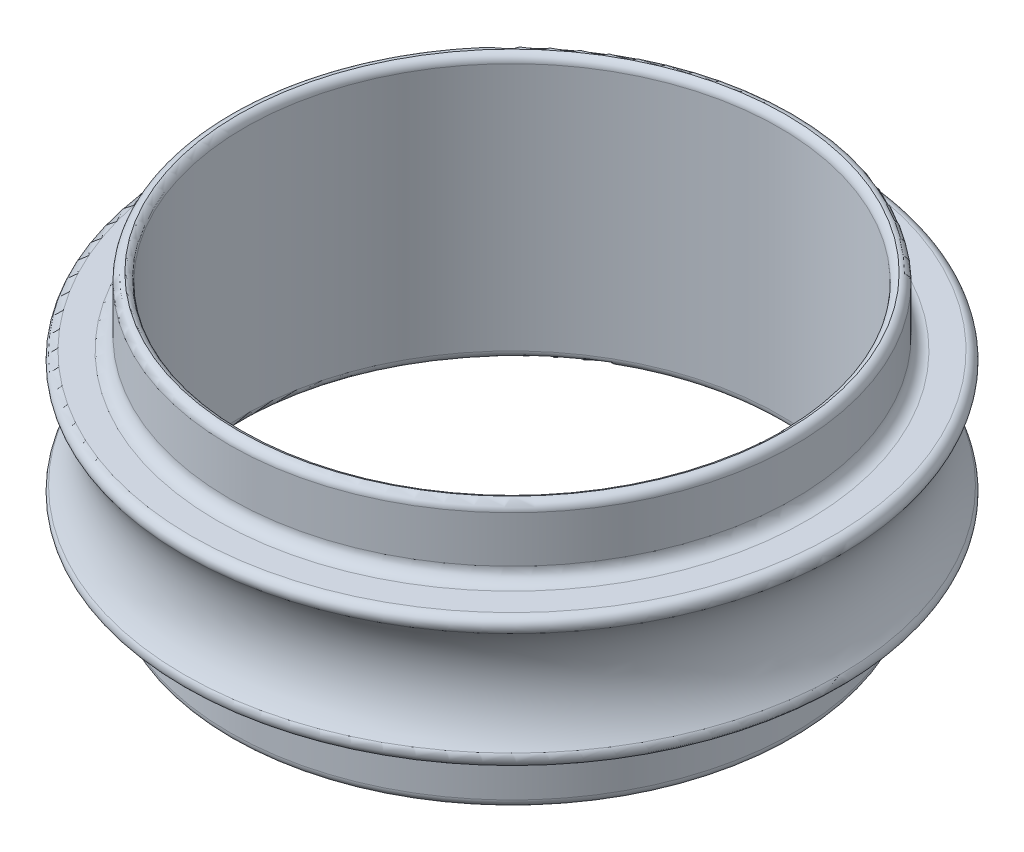
ISO-10303-21;
HEADER;
FILE_DESCRIPTION(('STEP AP214'),'2;1');
FILE_NAME('part.step','',(''),(''),'','','');
FILE_SCHEMA(('AUTOMOTIVE_DESIGN { 1 0 10303 214 1 1 1 1 }'));
ENDSEC;
DATA;
#1=APPLICATION_CONTEXT('core data for automotive mechanical design processes');
#2=APPLICATION_PROTOCOL_DEFINITION('international standard','automotive_design',2000,#1);
#3=PRODUCT_CONTEXT('',#1,'mechanical');
#4=PRODUCT('Part','Part','',(#3));
#5=PRODUCT_RELATED_PRODUCT_CATEGORY('part','',(#4));
#6=PRODUCT_DEFINITION_FORMATION('','',#4);
#7=PRODUCT_DEFINITION_CONTEXT('part definition',#1,'design');
#8=PRODUCT_DEFINITION('design','',#6,#7);
#9=PRODUCT_DEFINITION_SHAPE('','',#8);
#10=(LENGTH_UNIT() NAMED_UNIT(*) SI_UNIT(.MILLI.,.METRE.));
#11=(NAMED_UNIT(*) PLANE_ANGLE_UNIT() SI_UNIT($,.RADIAN.));
#12=(NAMED_UNIT(*) SI_UNIT($,.STERADIAN.) SOLID_ANGLE_UNIT());
#13=UNCERTAINTY_MEASURE_WITH_UNIT(LENGTH_MEASURE(1.E-05),#10,'distance_accuracy_value','');
#14=(GEOMETRIC_REPRESENTATION_CONTEXT(3) GLOBAL_UNCERTAINTY_ASSIGNED_CONTEXT((#13)) GLOBAL_UNIT_ASSIGNED_CONTEXT((#10,
#11,#12)) REPRESENTATION_CONTEXT('',''));
#15=CARTESIAN_POINT('',(0.,0.,0.));
#16=DIRECTION('',(0.,0.,1.));
#17=DIRECTION('',(1.,0.,0.));
#18=AXIS2_PLACEMENT_3D('',#15,#16,#17);
#19=CARTESIAN_POINT('',(0.,-34.5609634084468,0.));
#20=DIRECTION('',(0.,-1.,0.));
#21=DIRECTION('',(0.,0.,1.));
#22=AXIS2_PLACEMENT_3D('',#19,#20,#21);
#23=CYLINDRICAL_SURFACE('',#22,8.0645);
#24=CARTESIAN_POINT('',(0.,3.75456555751583,0.));
#25=DIRECTION('',(0.,1.,0.));
#26=DIRECTION('',(0.,0.,1.));
#27=AXIS2_PLACEMENT_3D('',#24,#25,#26);
#28=CIRCLE('',#27,8.0645);
#29=CARTESIAN_POINT('',(0.,3.75456555751583,8.0645));
#30=VERTEX_POINT('',#29);
#31=EDGE_CURVE('E10',#30,#30,#28,.T.);
#32=ORIENTED_EDGE('',*,*,#31,.T.);
#33=EDGE_LOOP('',(#32));
#34=FACE_BOUND('',#33,.T.);
#35=CARTESIAN_POINT('',(0.,-3.7465,0.));
#36=DIRECTION('',(0.,-1.,0.));
#37=DIRECTION('',(0.,0.,1.));
#38=AXIS2_PLACEMENT_3D('',#35,#36,#37);
#39=CIRCLE('',#38,8.0645);
#40=CARTESIAN_POINT('',(0.,-3.7465,8.0645));
#41=VERTEX_POINT('',#40);
#42=EDGE_CURVE('E22',#41,#41,#39,.T.);
#43=ORIENTED_EDGE('',*,*,#42,.T.);
#44=EDGE_LOOP('',(#43));
#45=FACE_BOUND('',#44,.T.);
#46=ADVANCED_FACE('F14',(#34,#45),#23,.F.);
#47=CARTESIAN_POINT('',(0.,3.75456555751583,0.));
#48=DIRECTION('',(0.,1.,0.));
#49=DIRECTION('',(0.,0.,1.));
#50=AXIS2_PLACEMENT_3D('',#47,#48,#49);
#51=TOROIDAL_SURFACE('',#50,8.3185,0.254);
#52=ORIENTED_EDGE('',*,*,#31,.F.);
#53=EDGE_LOOP('',(#52));
#54=FACE_BOUND('',#53,.T.);
#55=CARTESIAN_POINT('',(0.,4.0005,0.));
#56=DIRECTION('',(0.,1.,0.));
#57=DIRECTION('',(0.,0.,1.));
#58=AXIS2_PLACEMENT_3D('',#55,#56,#57);
#59=CIRCLE('',#58,8.255);
#60=CARTESIAN_POINT('',(0.,4.0005,8.255));
#61=VERTEX_POINT('',#60);
#62=EDGE_CURVE('E27',#61,#61,#59,.T.);
#63=ORIENTED_EDGE('',*,*,#62,.T.);
#64=EDGE_LOOP('',(#63));
#65=FACE_BOUND('',#64,.T.);
#66=ADVANCED_FACE('F71',(#54,#65),#51,.T.);
#67=CARTESIAN_POINT('',(0.,-1.9685,0.));
#68=DIRECTION('',(0.,1.,0.));
#69=DIRECTION('',(0.,0.,1.));
#70=AXIS2_PLACEMENT_3D('',#67,#68,#69);
#71=PLANE('',#70);
#72=CARTESIAN_POINT('',(0.,-1.9685,0.));
#73=DIRECTION('',(0.,-1.,0.));
#74=DIRECTION('',(0.,0.,1.));
#75=AXIS2_PLACEMENT_3D('',#72,#73,#74);
#76=CIRCLE('',#75,9.68108899871291);
#77=CARTESIAN_POINT('',(0.,-1.9685,9.68108899871291));
#78=VERTEX_POINT('',#77);
#79=EDGE_CURVE('E32',#78,#78,#76,.T.);
#80=ORIENTED_EDGE('',*,*,#79,.T.);
#81=EDGE_LOOP('',(#80));
#82=FACE_BOUND('',#81,.T.);
#83=CARTESIAN_POINT('',(0.,-1.9685,0.));
#84=DIRECTION('',(0.,1.,0.));
#85=DIRECTION('',(0.,0.,1.));
#86=AXIS2_PLACEMENT_3D('',#83,#84,#85);
#87=CIRCLE('',#86,8.89);
#88=CARTESIAN_POINT('',(0.,-1.9685,8.89));
#89=VERTEX_POINT('',#88);
#90=EDGE_CURVE('E35',#89,#89,#87,.T.);
#91=ORIENTED_EDGE('',*,*,#90,.T.);
#92=EDGE_LOOP('',(#91));
#93=FACE_BOUND('',#92,.T.);
#94=ADVANCED_FACE('F73',(#82,#93),#71,.F.);
#95=CARTESIAN_POINT('',(0.,-2.3495,0.));
#96=DIRECTION('',(0.,1.,0.));
#97=DIRECTION('',(0.,0.,1.));
#98=AXIS2_PLACEMENT_3D('',#95,#96,#97);
#99=TOROIDAL_SURFACE('',#98,8.89,0.381);
#100=CARTESIAN_POINT('',(0.,-2.3495,0.));
#101=DIRECTION('',(0.,-1.,0.));
#102=DIRECTION('',(0.,0.,1.));
#103=AXIS2_PLACEMENT_3D('',#100,#101,#102);
#104=CIRCLE('',#103,8.509);
#105=CARTESIAN_POINT('',(0.,-2.3495,8.509));
#106=VERTEX_POINT('',#105);
#107=EDGE_CURVE('E39',#106,#106,#104,.T.);
#108=ORIENTED_EDGE('',*,*,#107,.F.);
#109=EDGE_LOOP('',(#108));
#110=FACE_BOUND('',#109,.T.);
#111=ORIENTED_EDGE('',*,*,#90,.F.);
#112=EDGE_LOOP('',(#111));
#113=FACE_BOUND('',#112,.T.);
#114=ADVANCED_FACE('F81',(#110,#113),#99,.F.);
#115=CARTESIAN_POINT('',(0.,2.3495,0.));
#116=DIRECTION('',(0.,1.,0.));
#117=DIRECTION('',(0.,0.,1.));
#118=AXIS2_PLACEMENT_3D('',#115,#116,#117);
#119=TOROIDAL_SURFACE('',#118,8.89,0.381);
#120=CARTESIAN_POINT('',(0.,1.9685,0.));
#121=DIRECTION('',(0.,-1.,0.));
#122=DIRECTION('',(0.,0.,1.));
#123=AXIS2_PLACEMENT_3D('',#120,#121,#122);
#124=CIRCLE('',#123,8.89);
#125=CARTESIAN_POINT('',(0.,1.9685,8.89));
#126=VERTEX_POINT('',#125);
#127=EDGE_CURVE('E44',#126,#126,#124,.T.);
#128=ORIENTED_EDGE('',*,*,#127,.F.);
#129=EDGE_LOOP('',(#128));
#130=FACE_BOUND('',#129,.T.);
#131=CARTESIAN_POINT('',(0.,2.3495,0.));
#132=DIRECTION('',(0.,1.,0.));
#133=DIRECTION('',(0.,0.,1.));
#134=AXIS2_PLACEMENT_3D('',#131,#132,#133);
#135=CIRCLE('',#134,8.509);
#136=CARTESIAN_POINT('',(0.,2.3495,8.509));
#137=VERTEX_POINT('',#136);
#138=EDGE_CURVE('E48',#137,#137,#135,.T.);
#139=ORIENTED_EDGE('',*,*,#138,.F.);
#140=EDGE_LOOP('',(#139));
#141=FACE_BOUND('',#140,.T.);
#142=ADVANCED_FACE('F88',(#130,#141),#119,.F.);
#143=CARTESIAN_POINT('',(0.,0.,0.));
#144=DIRECTION('',(0.,1.,0.));
#145=DIRECTION('',(-1.,0.,0.));
#146=AXIS2_PLACEMENT_3D('',#143,#144,#145);
#147=TOROIDAL_SURFACE('',#146,11.8872,2.54);
#148=CARTESIAN_POINT('',(0.,1.55863636363638,0.));
#149=DIRECTION('',(0.,-1.,0.));
#150=DIRECTION('',(0.,0.,-1.));
#151=AXIS2_PLACEMENT_3D('',#148,#149,#150);
#152=CIRCLE('',#151,9.88164454428445);
#153=CARTESIAN_POINT('',(0.,1.55863636363638,-9.88164454428445));
#154=VERTEX_POINT('',#153);
#155=EDGE_CURVE('E38',#154,#154,#152,.T.);
#156=ORIENTED_EDGE('',*,*,#155,.T.);
#157=EDGE_LOOP('',(#156));
#158=FACE_BOUND('',#157,.T.);
#159=CARTESIAN_POINT('',(0.,-1.55863636363637,0.));
#160=DIRECTION('',(0.,1.,0.));
#161=DIRECTION('',(0.,0.,1.));
#162=AXIS2_PLACEMENT_3D('',#159,#160,#161);
#163=CIRCLE('',#162,9.88164454428447);
#164=CARTESIAN_POINT('',(0.,-1.55863636363637,9.88164454428447));
#165=VERTEX_POINT('',#164);
#166=EDGE_CURVE('E53',#165,#165,#163,.T.);
#167=ORIENTED_EDGE('',*,*,#166,.T.);
#168=EDGE_LOOP('',(#167));
#169=FACE_BOUND('',#168,.T.);
#170=ADVANCED_FACE('F92',(#158,#169),#147,.F.);
#171=CARTESIAN_POINT('',(0.,-1.7145,0.));
#172=DIRECTION('',(0.,-1.,0.));
#173=DIRECTION('',(0.,0.,-1.));
#174=AXIS2_PLACEMENT_3D('',#171,#172,#173);
#175=TOROIDAL_SURFACE('',#174,9.68108899871291,0.254);
#176=ORIENTED_EDGE('',*,*,#166,.F.);
#177=EDGE_LOOP('',(#176));
#178=FACE_BOUND('',#177,.T.);
#179=ORIENTED_EDGE('',*,*,#79,.F.);
#180=EDGE_LOOP('',(#179));
#181=FACE_BOUND('',#180,.T.);
#182=ADVANCED_FACE('F96',(#178,#181),#175,.T.);
#183=CARTESIAN_POINT('',(0.,1.9685,0.));
#184=DIRECTION('',(0.,1.,0.));
#185=DIRECTION('',(0.,0.,1.));
#186=AXIS2_PLACEMENT_3D('',#183,#184,#185);
#187=PLANE('',#186);
#188=CARTESIAN_POINT('',(0.,1.9685,0.));
#189=DIRECTION('',(0.,1.,0.));
#190=DIRECTION('',(0.,0.,1.));
#191=AXIS2_PLACEMENT_3D('',#188,#189,#190);
#192=CIRCLE('',#191,9.68108899871291);
#193=CARTESIAN_POINT('',(0.,1.9685,9.68108899871291));
#194=VERTEX_POINT('',#193);
#195=EDGE_CURVE('E47',#194,#194,#192,.T.);
#196=ORIENTED_EDGE('',*,*,#195,.T.);
#197=EDGE_LOOP('',(#196));
#198=FACE_BOUND('',#197,.T.);
#199=ORIENTED_EDGE('',*,*,#127,.T.);
#200=EDGE_LOOP('',(#199));
#201=FACE_BOUND('',#200,.T.);
#202=ADVANCED_FACE('F100',(#198,#201),#187,.T.);
#203=CARTESIAN_POINT('',(0.,-1.9685,0.));
#204=DIRECTION('',(0.,1.,0.));
#205=DIRECTION('',(0.,0.,-1.));
#206=AXIS2_PLACEMENT_3D('',#203,#204,#205);
#207=CYLINDRICAL_SURFACE('',#206,8.509);
#208=CARTESIAN_POINT('',(0.,-3.75456555751583,0.));
#209=DIRECTION('',(0.,1.,0.));
#210=DIRECTION('',(0.,0.,-1.));
#211=AXIS2_PLACEMENT_3D('',#208,#209,#210);
#212=CIRCLE('',#211,8.509);
#213=CARTESIAN_POINT('',(0.,-3.75456555751583,-8.509));
#214=VERTEX_POINT('',#213);
#215=EDGE_CURVE('E42',#214,#214,#212,.T.);
#216=ORIENTED_EDGE('',*,*,#215,.T.);
#217=EDGE_LOOP('',(#216));
#218=FACE_BOUND('',#217,.T.);
#219=ORIENTED_EDGE('',*,*,#107,.T.);
#220=EDGE_LOOP('',(#219));
#221=FACE_BOUND('',#220,.T.);
#222=ADVANCED_FACE('F104',(#218,#221),#207,.T.);
#223=CARTESIAN_POINT('',(0.,1.9685,0.));
#224=DIRECTION('',(0.,-1.,0.));
#225=DIRECTION('',(0.,0.,1.));
#226=AXIS2_PLACEMENT_3D('',#223,#224,#225);
#227=CYLINDRICAL_SURFACE('',#226,8.509);
#228=CARTESIAN_POINT('',(0.,3.7465,0.));
#229=DIRECTION('',(0.,-1.,0.));
#230=DIRECTION('',(0.,0.,1.));
#231=AXIS2_PLACEMENT_3D('',#228,#229,#230);
#232=CIRCLE('',#231,8.509);
#233=CARTESIAN_POINT('',(0.,3.7465,8.509));
#234=VERTEX_POINT('',#233);
#235=EDGE_CURVE('E43',#234,#234,#232,.T.);
#236=ORIENTED_EDGE('',*,*,#235,.T.);
#237=EDGE_LOOP('',(#236));
#238=FACE_BOUND('',#237,.T.);
#239=ORIENTED_EDGE('',*,*,#138,.T.);
#240=EDGE_LOOP('',(#239));
#241=FACE_BOUND('',#240,.T.);
#242=ADVANCED_FACE('F62',(#238,#241),#227,.T.);
#243=CARTESIAN_POINT('',(0.,1.7145,0.));
#244=DIRECTION('',(0.,-1.,0.));
#245=DIRECTION('',(0.,0.,-1.));
#246=AXIS2_PLACEMENT_3D('',#243,#244,#245);
#247=TOROIDAL_SURFACE('',#246,9.68108899871291,0.254);
#248=ORIENTED_EDGE('',*,*,#195,.F.);
#249=EDGE_LOOP('',(#248));
#250=FACE_BOUND('',#249,.T.);
#251=ORIENTED_EDGE('',*,*,#155,.F.);
#252=EDGE_LOOP('',(#251));
#253=FACE_BOUND('',#252,.T.);
#254=ADVANCED_FACE('F111',(#250,#253),#247,.T.);
#255=CARTESIAN_POINT('',(0.,-3.7465,0.));
#256=DIRECTION('',(0.,1.,0.));
#257=DIRECTION('',(0.,0.,1.));
#258=AXIS2_PLACEMENT_3D('',#255,#256,#257);
#259=TOROIDAL_SURFACE('',#258,8.3185,0.254);
#260=ORIENTED_EDGE('',*,*,#42,.F.);
#261=EDGE_LOOP('',(#260));
#262=FACE_BOUND('',#261,.T.);
#263=CARTESIAN_POINT('',(0.,-4.0005,0.));
#264=DIRECTION('',(0.,1.,0.));
#265=DIRECTION('',(0.,0.,1.));
#266=AXIS2_PLACEMENT_3D('',#263,#264,#265);
#267=CIRCLE('',#266,8.3185);
#268=CARTESIAN_POINT('',(0.,-4.0005,8.3185));
#269=VERTEX_POINT('',#268);
#270=EDGE_CURVE('E18',#269,#269,#267,.T.);
#271=ORIENTED_EDGE('',*,*,#270,.F.);
#272=EDGE_LOOP('',(#271));
#273=FACE_BOUND('',#272,.T.);
#274=ADVANCED_FACE('F68',(#262,#273),#259,.T.);
#275=CARTESIAN_POINT('',(0.,3.7465,0.));
#276=DIRECTION('',(0.,1.,0.));
#277=DIRECTION('',(0.,0.,1.));
#278=AXIS2_PLACEMENT_3D('',#275,#276,#277);
#279=TOROIDAL_SURFACE('',#278,8.255,0.254);
#280=ORIENTED_EDGE('',*,*,#235,.F.);
#281=EDGE_LOOP('',(#280));
#282=FACE_BOUND('',#281,.T.);
#283=ORIENTED_EDGE('',*,*,#62,.F.);
#284=EDGE_LOOP('',(#283));
#285=FACE_BOUND('',#284,.T.);
#286=ADVANCED_FACE('F65',(#282,#285),#279,.T.);
#287=CARTESIAN_POINT('',(0.,-3.75456555751583,0.));
#288=DIRECTION('',(0.,-1.,0.));
#289=DIRECTION('',(0.,0.,-1.));
#290=AXIS2_PLACEMENT_3D('',#287,#288,#289);
#291=TOROIDAL_SURFACE('',#290,8.255,0.254);
#292=ORIENTED_EDGE('',*,*,#270,.T.);
#293=EDGE_LOOP('',(#292));
#294=FACE_BOUND('',#293,.T.);
#295=ORIENTED_EDGE('',*,*,#215,.F.);
#296=EDGE_LOOP('',(#295));
#297=FACE_BOUND('',#296,.T.);
#298=ADVANCED_FACE('F16',(#294,#297),#291,.T.);
#299=CLOSED_SHELL('',(#46,#66,#94,#114,#142,#170,#182,#202,#222,#242,#254,#274,#286,#298));
#300=MANIFOLD_SOLID_BREP('B1',#299);
#301=ADVANCED_BREP_SHAPE_REPRESENTATION('',(#18,#300),#14);
#302=SHAPE_DEFINITION_REPRESENTATION(#9,#301);
ENDSEC;
END-ISO-10303-21;
